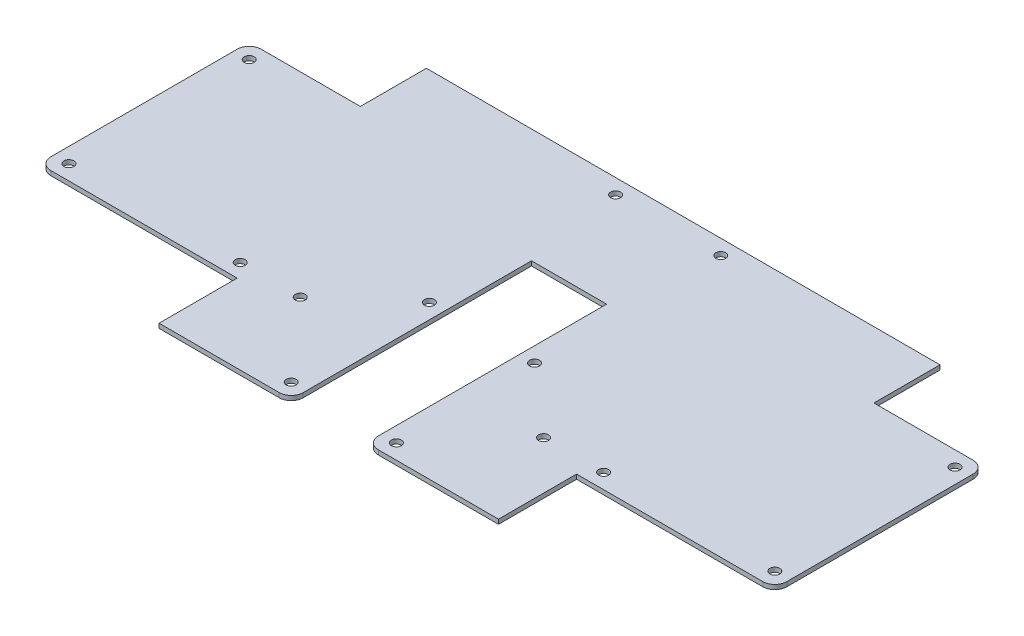
ISO-10303-21;
HEADER;
FILE_DESCRIPTION(('STEP AP214'),'2;1');
FILE_NAME('part.step','',(''),(''),'','','');
FILE_SCHEMA(('AUTOMOTIVE_DESIGN { 1 0 10303 214 1 1 1 1 }'));
ENDSEC;
DATA;
#1=APPLICATION_CONTEXT('core data for automotive mechanical design processes');
#2=APPLICATION_PROTOCOL_DEFINITION('international standard','automotive_design',2000,#1);
#3=PRODUCT_CONTEXT('',#1,'mechanical');
#4=PRODUCT('Part','Part','',(#3));
#5=PRODUCT_RELATED_PRODUCT_CATEGORY('part','',(#4));
#6=PRODUCT_DEFINITION_FORMATION('','',#4);
#7=PRODUCT_DEFINITION_CONTEXT('part definition',#1,'design');
#8=PRODUCT_DEFINITION('design','',#6,#7);
#9=PRODUCT_DEFINITION_SHAPE('','',#8);
#10=(LENGTH_UNIT() NAMED_UNIT(*) SI_UNIT(.MILLI.,.METRE.));
#11=(NAMED_UNIT(*) PLANE_ANGLE_UNIT() SI_UNIT($,.RADIAN.));
#12=(NAMED_UNIT(*) SI_UNIT($,.STERADIAN.) SOLID_ANGLE_UNIT());
#13=UNCERTAINTY_MEASURE_WITH_UNIT(LENGTH_MEASURE(1.E-05),#10,'distance_accuracy_value','');
#14=(GEOMETRIC_REPRESENTATION_CONTEXT(3) GLOBAL_UNCERTAINTY_ASSIGNED_CONTEXT((#13)) GLOBAL_UNIT_ASSIGNED_CONTEXT((#10,
#11,#12)) REPRESENTATION_CONTEXT('',''));
#15=CARTESIAN_POINT('',(0.,0.,0.));
#16=DIRECTION('',(0.,0.,1.));
#17=DIRECTION('',(1.,0.,0.));
#18=AXIS2_PLACEMENT_3D('',#15,#16,#17);
#19=CARTESIAN_POINT('',(0.,1.5,0.));
#20=DIRECTION('',(0.,0.,-1.));
#21=DIRECTION('',(-1.,0.,0.));
#22=AXIS2_PLACEMENT_3D('',#19,#20,#21);
#23=PLANE('',#22);
#24=DIRECTION('',(1.,0.,0.));
#25=VECTOR('',#24,1.);
#26=CARTESIAN_POINT('',(0.,0.,0.));
#27=LINE('',#26,#25);
#28=CARTESIAN_POINT('',(66.,0.,0.));
#29=VERTEX_POINT('',#28);
#30=CARTESIAN_POINT('',(106.,0.,0.));
#31=VERTEX_POINT('',#30);
#32=EDGE_CURVE('E186',#29,#31,#27,.T.);
#33=ORIENTED_EDGE('',*,*,#32,.T.);
#34=DIRECTION('',(0.,1.,0.));
#35=VECTOR('',#34,1.);
#36=CARTESIAN_POINT('',(106.,1.5,0.));
#37=LINE('',#36,#35);
#38=CARTESIAN_POINT('',(106.,1.5,0.));
#39=VERTEX_POINT('',#38);
#40=EDGE_CURVE('E293',#31,#39,#37,.T.);
#41=ORIENTED_EDGE('',*,*,#40,.T.);
#42=DIRECTION('',(1.,0.,0.));
#43=VECTOR('',#42,1.);
#44=CARTESIAN_POINT('',(0.,1.5,0.));
#45=LINE('',#44,#43);
#46=CARTESIAN_POINT('',(66.,1.5,0.));
#47=VERTEX_POINT('',#46);
#48=EDGE_CURVE('E286',#47,#39,#45,.T.);
#49=ORIENTED_EDGE('',*,*,#48,.F.);
#50=DIRECTION('',(0.,1.,0.));
#51=VECTOR('',#50,1.);
#52=CARTESIAN_POINT('',(66.,0.,0.));
#53=LINE('',#52,#51);
#54=EDGE_CURVE('E241',#29,#47,#53,.T.);
#55=ORIENTED_EDGE('',*,*,#54,.F.);
#56=EDGE_LOOP('',(#33,#41,#49,#55));
#57=FACE_BOUND('',#56,.T.);
#58=ADVANCED_FACE('F33',(#57),#23,.F.);
#59=CARTESIAN_POINT('',(0.,1.5,0.));
#60=DIRECTION('',(1.,0.,0.));
#61=DIRECTION('',(0.,0.,-1.));
#62=AXIS2_PLACEMENT_3D('',#59,#60,#61);
#63=PLANE('',#62);
#64=DIRECTION('',(0.,0.,1.));
#65=VECTOR('',#64,1.);
#66=CARTESIAN_POINT('',(0.,0.,0.));
#67=LINE('',#66,#65);
#68=CARTESIAN_POINT('',(0.,0.,-92.));
#69=VERTEX_POINT('',#68);
#70=CARTESIAN_POINT('',(0.,0.,-30.));
#71=VERTEX_POINT('',#70);
#72=EDGE_CURVE('E187',#69,#71,#67,.T.);
#73=ORIENTED_EDGE('',*,*,#72,.T.);
#74=DIRECTION('',(0.,1.,0.));
#75=VECTOR('',#74,1.);
#76=CARTESIAN_POINT('',(0.,1.5,-30.));
#77=LINE('',#76,#75);
#78=CARTESIAN_POINT('',(0.,1.5,-30.));
#79=VERTEX_POINT('',#78);
#80=EDGE_CURVE('E344',#71,#79,#77,.T.);
#81=ORIENTED_EDGE('',*,*,#80,.T.);
#82=DIRECTION('',(0.,0.,1.));
#83=VECTOR('',#82,1.);
#84=CARTESIAN_POINT('',(0.,1.5,0.));
#85=LINE('',#84,#83);
#86=CARTESIAN_POINT('',(0.,1.5,-92.));
#87=VERTEX_POINT('',#86);
#88=EDGE_CURVE('E280',#87,#79,#85,.T.);
#89=ORIENTED_EDGE('',*,*,#88,.F.);
#90=DIRECTION('',(0.,1.,0.));
#91=VECTOR('',#90,1.);
#92=CARTESIAN_POINT('',(0.,1.5,-92.));
#93=LINE('',#92,#91);
#94=EDGE_CURVE('E342',#87,#69,#93,.F.);
#95=ORIENTED_EDGE('',*,*,#94,.T.);
#96=EDGE_LOOP('',(#73,#81,#89,#95));
#97=FACE_BOUND('',#96,.T.);
#98=ADVANCED_FACE('F359',(#97),#63,.F.);
#99=CARTESIAN_POINT('',(139.,1.5,0.));
#100=VERTEX_POINT('',#99);
#101=CARTESIAN_POINT('',(179.,1.5,0.));
#102=VERTEX_POINT('',#101);
#103=EDGE_CURVE('E283',#100,#102,#45,.T.);
#104=ORIENTED_EDGE('',*,*,#103,.F.);
#105=DIRECTION('',(0.,1.,0.));
#106=VECTOR('',#105,1.);
#107=CARTESIAN_POINT('',(139.,1.5,0.));
#108=LINE('',#107,#106);
#109=CARTESIAN_POINT('',(139.,0.,0.));
#110=VERTEX_POINT('',#109);
#111=EDGE_CURVE('E56',#100,#110,#108,.F.);
#112=ORIENTED_EDGE('',*,*,#111,.T.);
#113=CARTESIAN_POINT('',(179.,0.,0.));
#114=VERTEX_POINT('',#113);
#115=EDGE_CURVE('E181',#110,#114,#27,.T.);
#116=ORIENTED_EDGE('',*,*,#115,.T.);
#117=DIRECTION('',(0.,1.,0.));
#118=VECTOR('',#117,1.);
#119=CARTESIAN_POINT('',(179.,0.,0.));
#120=LINE('',#119,#118);
#121=EDGE_CURVE('E184',#114,#102,#120,.T.);
#122=ORIENTED_EDGE('',*,*,#121,.T.);
#123=EDGE_LOOP('',(#104,#112,#116,#122));
#124=FACE_BOUND('',#123,.T.);
#125=ADVANCED_FACE('F183',(#124),#23,.F.);
#126=CARTESIAN_POINT('',(245.,1.5,0.));
#127=DIRECTION('',(-1.,0.,0.));
#128=DIRECTION('',(0.,0.,1.));
#129=AXIS2_PLACEMENT_3D('',#126,#127,#128);
#130=PLANE('',#129);
#131=DIRECTION('',(0.,0.,-1.));
#132=VECTOR('',#131,1.);
#133=CARTESIAN_POINT('',(245.,1.5,0.));
#134=LINE('',#133,#132);
#135=CARTESIAN_POINT('',(245.,1.5,-30.));
#136=VERTEX_POINT('',#135);
#137=CARTESIAN_POINT('',(245.,1.5,-92.));
#138=VERTEX_POINT('',#137);
#139=EDGE_CURVE('E287',#136,#138,#134,.T.);
#140=ORIENTED_EDGE('',*,*,#139,.F.);
#141=DIRECTION('',(0.,1.,0.));
#142=VECTOR('',#141,1.);
#143=CARTESIAN_POINT('',(245.,1.5,-30.));
#144=LINE('',#143,#142);
#145=CARTESIAN_POINT('',(245.,0.,-30.));
#146=VERTEX_POINT('',#145);
#147=EDGE_CURVE('E338',#136,#146,#144,.F.);
#148=ORIENTED_EDGE('',*,*,#147,.T.);
#149=DIRECTION('',(0.,0.,-1.));
#150=VECTOR('',#149,1.);
#151=CARTESIAN_POINT('',(245.,0.,0.));
#152=LINE('',#151,#150);
#153=CARTESIAN_POINT('',(245.,0.,-92.));
#154=VERTEX_POINT('',#153);
#155=EDGE_CURVE('E296',#146,#154,#152,.T.);
#156=ORIENTED_EDGE('',*,*,#155,.T.);
#157=DIRECTION('',(0.,1.,0.));
#158=VECTOR('',#157,1.);
#159=CARTESIAN_POINT('',(245.,1.5,-92.));
#160=LINE('',#159,#158);
#161=EDGE_CURVE('E335',#154,#138,#160,.T.);
#162=ORIENTED_EDGE('',*,*,#161,.T.);
#163=EDGE_LOOP('',(#140,#148,#156,#162));
#164=FACE_BOUND('',#163,.T.);
#165=ADVANCED_FACE('F395',(#164),#130,.F.);
#166=CARTESIAN_POINT('',(0.,1.5,-118.));
#167=DIRECTION('',(0.,0.,1.));
#168=DIRECTION('',(1.,0.,0.));
#169=AXIS2_PLACEMENT_3D('',#166,#167,#168);
#170=PLANE('',#169);
#171=DIRECTION('',(-1.,0.,0.));
#172=VECTOR('',#171,1.);
#173=CARTESIAN_POINT('',(0.,1.5,-118.));
#174=LINE('',#173,#172);
#175=CARTESIAN_POINT('',(208.,1.5,-118.));
#176=VERTEX_POINT('',#175);
#177=CARTESIAN_POINT('',(37.,1.5,-118.));
#178=VERTEX_POINT('',#177);
#179=EDGE_CURVE('E290',#176,#178,#174,.T.);
#180=ORIENTED_EDGE('',*,*,#179,.F.);
#181=DIRECTION('',(0.,1.,0.));
#182=VECTOR('',#181,1.);
#183=CARTESIAN_POINT('',(208.,0.,-118.));
#184=LINE('',#183,#182);
#185=CARTESIAN_POINT('',(208.,0.,-118.));
#186=VERTEX_POINT('',#185);
#187=EDGE_CURVE('E259',#186,#176,#184,.T.);
#188=ORIENTED_EDGE('',*,*,#187,.F.);
#189=DIRECTION('',(-1.,0.,0.));
#190=VECTOR('',#189,1.);
#191=CARTESIAN_POINT('',(0.,0.,-118.));
#192=LINE('',#191,#190);
#193=CARTESIAN_POINT('',(37.,0.,-118.));
#194=VERTEX_POINT('',#193);
#195=EDGE_CURVE('E284',#186,#194,#192,.T.);
#196=ORIENTED_EDGE('',*,*,#195,.T.);
#197=DIRECTION('',(0.,1.,0.));
#198=VECTOR('',#197,1.);
#199=CARTESIAN_POINT('',(37.,0.,-118.));
#200=LINE('',#199,#198);
#201=EDGE_CURVE('E275',#194,#178,#200,.T.);
#202=ORIENTED_EDGE('',*,*,#201,.T.);
#203=EDGE_LOOP('',(#180,#188,#196,#202));
#204=FACE_BOUND('',#203,.T.);
#205=ADVANCED_FACE('F379',(#204),#170,.F.);
#206=CARTESIAN_POINT('',(0.,1.5,0.));
#207=DIRECTION('',(0.,-1.,0.));
#208=DIRECTION('',(0.,0.,-1.));
#209=AXIS2_PLACEMENT_3D('',#206,#207,#208);
#210=PLANE('',#209);
#211=CARTESIAN_POINT('',(105.,1.5,-51.));
#212=DIRECTION('',(0.,-1.,0.));
#213=DIRECTION('',(0.,0.,-1.));
#214=AXIS2_PLACEMENT_3D('',#211,#212,#213);
#215=CIRCLE('',#214,1.65);
#216=CARTESIAN_POINT('',(105.,1.5,-52.65));
#217=VERTEX_POINT('',#216);
#218=EDGE_CURVE('E227',#217,#217,#215,.T.);
#219=ORIENTED_EDGE('',*,*,#218,.T.);
#220=EDGE_LOOP('',(#219));
#221=FACE_BOUND('',#220,.T.);
#222=CARTESIAN_POINT('',(105.,1.5,-113.));
#223=DIRECTION('',(0.,-1.,0.));
#224=DIRECTION('',(0.,0.,-1.));
#225=AXIS2_PLACEMENT_3D('',#222,#223,#224);
#226=CIRCLE('',#225,1.65);
#227=CARTESIAN_POINT('',(105.,1.5,-114.65));
#228=VERTEX_POINT('',#227);
#229=EDGE_CURVE('E769',#228,#228,#226,.T.);
#230=ORIENTED_EDGE('',*,*,#229,.T.);
#231=EDGE_LOOP('',(#230));
#232=FACE_BOUND('',#231,.T.);
#233=CARTESIAN_POINT('',(105.,1.5,-5.));
#234=DIRECTION('',(0.,-1.,0.));
#235=DIRECTION('',(0.,0.,-1.));
#236=AXIS2_PLACEMENT_3D('',#233,#234,#235);
#237=CIRCLE('',#236,1.65);
#238=CARTESIAN_POINT('',(105.,1.5,-6.65000000000001));
#239=VERTEX_POINT('',#238);
#240=EDGE_CURVE('E771',#239,#239,#237,.T.);
#241=ORIENTED_EDGE('',*,*,#240,.T.);
#242=EDGE_LOOP('',(#241));
#243=FACE_BOUND('',#242,.T.);
#244=CARTESIAN_POINT('',(5.,1.5,-91.));
#245=DIRECTION('',(0.,-1.,0.));
#246=DIRECTION('',(0.,0.,-1.));
#247=AXIS2_PLACEMENT_3D('',#244,#245,#246);
#248=CIRCLE('',#247,1.65);
#249=CARTESIAN_POINT('',(5.,1.5,-92.65));
#250=VERTEX_POINT('',#249);
#251=EDGE_CURVE('E776',#250,#250,#248,.T.);
#252=ORIENTED_EDGE('',*,*,#251,.T.);
#253=EDGE_LOOP('',(#252));
#254=FACE_BOUND('',#253,.T.);
#255=CARTESIAN_POINT('',(240.,1.5,-31.));
#256=DIRECTION('',(0.,-1.,0.));
#257=DIRECTION('',(0.,0.,-1.));
#258=AXIS2_PLACEMENT_3D('',#255,#256,#257);
#259=CIRCLE('',#258,1.65000000000002);
#260=CARTESIAN_POINT('',(240.,1.5,-32.65));
#261=VERTEX_POINT('',#260);
#262=EDGE_CURVE('E779',#261,#261,#259,.T.);
#263=ORIENTED_EDGE('',*,*,#262,.T.);
#264=EDGE_LOOP('',(#263));
#265=FACE_BOUND('',#264,.T.);
#266=CARTESIAN_POINT('',(140.,1.5,-113.));
#267=DIRECTION('',(0.,-1.,0.));
#268=DIRECTION('',(0.,0.,-1.));
#269=AXIS2_PLACEMENT_3D('',#266,#267,#268);
#270=CIRCLE('',#269,1.65000000000002);
#271=CARTESIAN_POINT('',(140.,1.5,-114.65));
#272=VERTEX_POINT('',#271);
#273=EDGE_CURVE('E782',#272,#272,#270,.T.);
#274=ORIENTED_EDGE('',*,*,#273,.T.);
#275=EDGE_LOOP('',(#274));
#276=FACE_BOUND('',#275,.T.);
#277=CARTESIAN_POINT('',(140.,1.5,-5.));
#278=DIRECTION('',(0.,-1.,0.));
#279=DIRECTION('',(0.,0.,-1.));
#280=AXIS2_PLACEMENT_3D('',#277,#278,#279);
#281=CIRCLE('',#280,1.65000000000002);
#282=CARTESIAN_POINT('',(140.,1.5,-6.65000000000002));
#283=VERTEX_POINT('',#282);
#284=EDGE_CURVE('E785',#283,#283,#281,.T.);
#285=ORIENTED_EDGE('',*,*,#284,.T.);
#286=EDGE_LOOP('',(#285));
#287=FACE_BOUND('',#286,.T.);
#288=CARTESIAN_POINT('',(140.,1.5,-51.));
#289=DIRECTION('',(0.,-1.,0.));
#290=DIRECTION('',(0.,0.,-1.));
#291=AXIS2_PLACEMENT_3D('',#288,#289,#290);
#292=CIRCLE('',#291,1.65000000000002);
#293=CARTESIAN_POINT('',(140.,1.5,-52.65));
#294=VERTEX_POINT('',#293);
#295=EDGE_CURVE('E788',#294,#294,#292,.T.);
#296=ORIENTED_EDGE('',*,*,#295,.T.);
#297=EDGE_LOOP('',(#296));
#298=FACE_BOUND('',#297,.T.);
#299=CARTESIAN_POINT('',(183.,1.5,-31.));
#300=DIRECTION('',(0.,-1.,0.));
#301=DIRECTION('',(0.,0.,-1.));
#302=AXIS2_PLACEMENT_3D('',#299,#300,#301);
#303=CIRCLE('',#302,1.64999999999999);
#304=CARTESIAN_POINT('',(183.,1.5,-32.65));
#305=VERTEX_POINT('',#304);
#306=EDGE_CURVE('E791',#305,#305,#303,.T.);
#307=ORIENTED_EDGE('',*,*,#306,.T.);
#308=EDGE_LOOP('',(#307));
#309=FACE_BOUND('',#308,.T.);
#310=CARTESIAN_POINT('',(240.,1.5,-91.));
#311=DIRECTION('',(0.,-1.,0.));
#312=DIRECTION('',(0.,0.,-1.));
#313=AXIS2_PLACEMENT_3D('',#310,#311,#312);
#314=CIRCLE('',#313,1.65000000000002);
#315=CARTESIAN_POINT('',(240.,1.5,-92.65));
#316=VERTEX_POINT('',#315);
#317=EDGE_CURVE('E794',#316,#316,#314,.T.);
#318=ORIENTED_EDGE('',*,*,#317,.T.);
#319=EDGE_LOOP('',(#318));
#320=FACE_BOUND('',#319,.T.);
#321=CARTESIAN_POINT('',(62.,1.5,-31.));
#322=DIRECTION('',(0.,-1.,0.));
#323=DIRECTION('',(0.,0.,-1.));
#324=AXIS2_PLACEMENT_3D('',#321,#322,#323);
#325=CIRCLE('',#324,1.65);
#326=CARTESIAN_POINT('',(62.,1.5,-32.65));
#327=VERTEX_POINT('',#326);
#328=EDGE_CURVE('E797',#327,#327,#325,.T.);
#329=ORIENTED_EDGE('',*,*,#328,.T.);
#330=EDGE_LOOP('',(#329));
#331=FACE_BOUND('',#330,.T.);
#332=CARTESIAN_POINT('',(82.,1.5,-31.));
#333=DIRECTION('',(0.,-1.,0.));
#334=DIRECTION('',(0.,0.,-1.));
#335=AXIS2_PLACEMENT_3D('',#332,#333,#334);
#336=CIRCLE('',#335,1.65);
#337=CARTESIAN_POINT('',(82.,1.5,-32.65));
#338=VERTEX_POINT('',#337);
#339=EDGE_CURVE('E800',#338,#338,#336,.T.);
#340=ORIENTED_EDGE('',*,*,#339,.T.);
#341=EDGE_LOOP('',(#340));
#342=FACE_BOUND('',#341,.T.);
#343=CARTESIAN_POINT('',(163.,1.5,-31.));
#344=DIRECTION('',(0.,-1.,0.));
#345=DIRECTION('',(0.,0.,-1.));
#346=AXIS2_PLACEMENT_3D('',#343,#344,#345);
#347=CIRCLE('',#346,1.64999999999999);
#348=CARTESIAN_POINT('',(163.,1.5,-32.65));
#349=VERTEX_POINT('',#348);
#350=EDGE_CURVE('E803',#349,#349,#347,.T.);
#351=ORIENTED_EDGE('',*,*,#350,.T.);
#352=EDGE_LOOP('',(#351));
#353=FACE_BOUND('',#352,.T.);
#354=CARTESIAN_POINT('',(5.,1.5,-31.));
#355=DIRECTION('',(0.,-1.,0.));
#356=DIRECTION('',(0.,0.,-1.));
#357=AXIS2_PLACEMENT_3D('',#354,#355,#356);
#358=CIRCLE('',#357,1.65);
#359=CARTESIAN_POINT('',(5.,1.5,-32.65));
#360=VERTEX_POINT('',#359);
#361=EDGE_CURVE('E806',#360,#360,#358,.T.);
#362=ORIENTED_EDGE('',*,*,#361,.T.);
#363=EDGE_LOOP('',(#362));
#364=FACE_BOUND('',#363,.T.);
#365=ORIENTED_EDGE('',*,*,#48,.T.);
#366=CARTESIAN_POINT('',(106.,1.5,-4.));
#367=DIRECTION('',(0.,-1.,0.));
#368=DIRECTION('',(0.,0.,-1.));
#369=AXIS2_PLACEMENT_3D('',#366,#367,#368);
#370=CIRCLE('',#369,4.);
#371=CARTESIAN_POINT('',(110.,1.5,-4.));
#372=VERTEX_POINT('',#371);
#373=EDGE_CURVE('E313',#39,#372,#370,.F.);
#374=ORIENTED_EDGE('',*,*,#373,.T.);
#375=DIRECTION('',(0.,0.,1.));
#376=VECTOR('',#375,1.);
#377=CARTESIAN_POINT('',(110.,1.5,0.));
#378=LINE('',#377,#376);
#379=CARTESIAN_POINT('',(110.,1.5,-80.));
#380=VERTEX_POINT('',#379);
#381=EDGE_CURVE('E223',#380,#372,#378,.T.);
#382=ORIENTED_EDGE('',*,*,#381,.F.);
#383=DIRECTION('',(-1.,0.,0.));
#384=VECTOR('',#383,1.);
#385=CARTESIAN_POINT('',(110.,1.5,-80.));
#386=LINE('',#385,#384);
#387=CARTESIAN_POINT('',(135.,1.5,-80.));
#388=VERTEX_POINT('',#387);
#389=EDGE_CURVE('E217',#388,#380,#386,.T.);
#390=ORIENTED_EDGE('',*,*,#389,.F.);
#391=DIRECTION('',(0.,0.,-1.));
#392=VECTOR('',#391,1.);
#393=CARTESIAN_POINT('',(135.,1.5,0.));
#394=LINE('',#393,#392);
#395=CARTESIAN_POINT('',(135.,1.5,-4.));
#396=VERTEX_POINT('',#395);
#397=EDGE_CURVE('E226',#396,#388,#394,.T.);
#398=ORIENTED_EDGE('',*,*,#397,.F.);
#399=CARTESIAN_POINT('',(139.,1.5,-4.));
#400=DIRECTION('',(0.,-1.,0.));
#401=DIRECTION('',(0.,0.,-1.));
#402=AXIS2_PLACEMENT_3D('',#399,#400,#401);
#403=CIRCLE('',#402,4.);
#404=EDGE_CURVE('E311',#396,#100,#403,.F.);
#405=ORIENTED_EDGE('',*,*,#404,.T.);
#406=ORIENTED_EDGE('',*,*,#103,.T.);
#407=DIRECTION('',(0.,0.,1.));
#408=VECTOR('',#407,1.);
#409=CARTESIAN_POINT('',(179.,1.5,0.));
#410=LINE('',#409,#408);
#411=CARTESIAN_POINT('',(179.,1.5,-26.));
#412=VERTEX_POINT('',#411);
#413=EDGE_CURVE('E197',#412,#102,#410,.T.);
#414=ORIENTED_EDGE('',*,*,#413,.F.);
#415=DIRECTION('',(-1.,0.,0.));
#416=VECTOR('',#415,1.);
#417=CARTESIAN_POINT('',(245.,1.5,-26.));
#418=LINE('',#417,#416);
#419=CARTESIAN_POINT('',(241.,1.5,-26.));
#420=VERTEX_POINT('',#419);
#421=EDGE_CURVE('E210',#420,#412,#418,.T.);
#422=ORIENTED_EDGE('',*,*,#421,.F.);
#423=CARTESIAN_POINT('',(241.,1.5,-30.));
#424=DIRECTION('',(0.,-1.,0.));
#425=DIRECTION('',(0.,0.,-1.));
#426=AXIS2_PLACEMENT_3D('',#423,#424,#425);
#427=CIRCLE('',#426,4.);
#428=EDGE_CURVE('E309',#420,#136,#427,.F.);
#429=ORIENTED_EDGE('',*,*,#428,.T.);
#430=ORIENTED_EDGE('',*,*,#139,.T.);
#431=CARTESIAN_POINT('',(241.,1.5,-92.));
#432=DIRECTION('',(0.,-1.,0.));
#433=DIRECTION('',(0.,0.,-1.));
#434=AXIS2_PLACEMENT_3D('',#431,#432,#433);
#435=CIRCLE('',#434,4.);
#436=CARTESIAN_POINT('',(241.,1.5,-96.));
#437=VERTEX_POINT('',#436);
#438=EDGE_CURVE('E307',#138,#437,#435,.F.);
#439=ORIENTED_EDGE('',*,*,#438,.T.);
#440=DIRECTION('',(1.,0.,0.));
#441=VECTOR('',#440,1.);
#442=CARTESIAN_POINT('',(245.,1.5,-96.));
#443=LINE('',#442,#441);
#444=CARTESIAN_POINT('',(208.,1.5,-96.));
#445=VERTEX_POINT('',#444);
#446=EDGE_CURVE('E256',#445,#437,#443,.T.);
#447=ORIENTED_EDGE('',*,*,#446,.F.);
#448=DIRECTION('',(0.,0.,1.));
#449=VECTOR('',#448,1.);
#450=CARTESIAN_POINT('',(208.,1.5,-118.));
#451=LINE('',#450,#449);
#452=EDGE_CURVE('E198',#176,#445,#451,.T.);
#453=ORIENTED_EDGE('',*,*,#452,.F.);
#454=ORIENTED_EDGE('',*,*,#179,.T.);
#455=DIRECTION('',(0.,0.,-1.));
#456=VECTOR('',#455,1.);
#457=CARTESIAN_POINT('',(37.,1.5,-118.));
#458=LINE('',#457,#456);
#459=CARTESIAN_POINT('',(37.,1.5,-96.));
#460=VERTEX_POINT('',#459);
#461=EDGE_CURVE('E269',#460,#178,#458,.T.);
#462=ORIENTED_EDGE('',*,*,#461,.F.);
#463=DIRECTION('',(1.,0.,0.));
#464=VECTOR('',#463,1.);
#465=CARTESIAN_POINT('',(0.,1.5,-96.));
#466=LINE('',#465,#464);
#467=CARTESIAN_POINT('',(4.,1.5,-96.));
#468=VERTEX_POINT('',#467);
#469=EDGE_CURVE('E250',#468,#460,#466,.T.);
#470=ORIENTED_EDGE('',*,*,#469,.F.);
#471=CARTESIAN_POINT('',(4.,1.5,-92.));
#472=DIRECTION('',(0.,-1.,0.));
#473=DIRECTION('',(0.,0.,-1.));
#474=AXIS2_PLACEMENT_3D('',#471,#472,#473);
#475=CIRCLE('',#474,4.);
#476=EDGE_CURVE('E303',#468,#87,#475,.F.);
#477=ORIENTED_EDGE('',*,*,#476,.T.);
#478=ORIENTED_EDGE('',*,*,#88,.T.);
#479=CARTESIAN_POINT('',(4.,1.5,-30.));
#480=DIRECTION('',(0.,-1.,0.));
#481=DIRECTION('',(0.,0.,-1.));
#482=AXIS2_PLACEMENT_3D('',#479,#480,#481);
#483=CIRCLE('',#482,4.);
#484=CARTESIAN_POINT('',(4.,1.5,-26.));
#485=VERTEX_POINT('',#484);
#486=EDGE_CURVE('E305',#79,#485,#483,.F.);
#487=ORIENTED_EDGE('',*,*,#486,.T.);
#488=DIRECTION('',(-1.,0.,0.));
#489=VECTOR('',#488,1.);
#490=CARTESIAN_POINT('',(0.,1.5,-26.));
#491=LINE('',#490,#489);
#492=CARTESIAN_POINT('',(66.,1.5,-26.));
#493=VERTEX_POINT('',#492);
#494=EDGE_CURVE('E238',#493,#485,#491,.T.);
#495=ORIENTED_EDGE('',*,*,#494,.F.);
#496=DIRECTION('',(0.,0.,-1.));
#497=VECTOR('',#496,1.);
#498=CARTESIAN_POINT('',(66.,1.5,0.));
#499=LINE('',#498,#497);
#500=EDGE_CURVE('E242',#47,#493,#499,.T.);
#501=ORIENTED_EDGE('',*,*,#500,.F.);
#502=EDGE_LOOP('',(#365,#374,#382,#390,#398,#405,#406,#414,#422,#429,#430,#439,#447,#453,#454,
#462,#470,#477,#478,#487,#495,#501));
#503=FACE_BOUND('',#502,.T.);
#504=ADVANCED_FACE('F363',(#221,#232,#243,#254,#265,#276,#287,#298,#309,#320,#331,#342,#353,
#364,#503),#210,.F.);
#505=CARTESIAN_POINT('',(0.,0.,0.));
#506=DIRECTION('',(0.,-1.,0.));
#507=DIRECTION('',(0.,0.,-1.));
#508=AXIS2_PLACEMENT_3D('',#505,#506,#507);
#509=PLANE('',#508);
#510=CARTESIAN_POINT('',(105.,0.,-51.));
#511=DIRECTION('',(0.,-1.,0.));
#512=DIRECTION('',(0.,0.,-1.));
#513=AXIS2_PLACEMENT_3D('',#510,#511,#512);
#514=CIRCLE('',#513,1.65);
#515=CARTESIAN_POINT('',(105.,0.,-52.65));
#516=VERTEX_POINT('',#515);
#517=EDGE_CURVE('E766',#516,#516,#514,.T.);
#518=ORIENTED_EDGE('',*,*,#517,.F.);
#519=EDGE_LOOP('',(#518));
#520=FACE_BOUND('',#519,.T.);
#521=CARTESIAN_POINT('',(105.,0.,-113.));
#522=DIRECTION('',(0.,-1.,0.));
#523=DIRECTION('',(0.,0.,-1.));
#524=AXIS2_PLACEMENT_3D('',#521,#522,#523);
#525=CIRCLE('',#524,1.65);
#526=CARTESIAN_POINT('',(105.,0.,-114.65));
#527=VERTEX_POINT('',#526);
#528=EDGE_CURVE('E829',#527,#527,#525,.T.);
#529=ORIENTED_EDGE('',*,*,#528,.F.);
#530=EDGE_LOOP('',(#529));
#531=FACE_BOUND('',#530,.T.);
#532=CARTESIAN_POINT('',(105.,0.,-5.));
#533=DIRECTION('',(0.,-1.,0.));
#534=DIRECTION('',(0.,0.,-1.));
#535=AXIS2_PLACEMENT_3D('',#532,#533,#534);
#536=CIRCLE('',#535,1.65);
#537=CARTESIAN_POINT('',(105.,0.,-6.65000000000001));
#538=VERTEX_POINT('',#537);
#539=EDGE_CURVE('E826',#538,#538,#536,.T.);
#540=ORIENTED_EDGE('',*,*,#539,.F.);
#541=EDGE_LOOP('',(#540));
#542=FACE_BOUND('',#541,.T.);
#543=CARTESIAN_POINT('',(5.,0.,-91.));
#544=DIRECTION('',(0.,-1.,0.));
#545=DIRECTION('',(0.,0.,-1.));
#546=AXIS2_PLACEMENT_3D('',#543,#544,#545);
#547=CIRCLE('',#546,1.65);
#548=CARTESIAN_POINT('',(5.,0.,-92.65));
#549=VERTEX_POINT('',#548);
#550=EDGE_CURVE('E812',#549,#549,#547,.T.);
#551=ORIENTED_EDGE('',*,*,#550,.F.);
#552=EDGE_LOOP('',(#551));
#553=FACE_BOUND('',#552,.T.);
#554=CARTESIAN_POINT('',(240.,0.,-31.));
#555=DIRECTION('',(0.,-1.,0.));
#556=DIRECTION('',(0.,0.,1.));
#557=AXIS2_PLACEMENT_3D('',#554,#555,#556);
#558=CIRCLE('',#557,1.65000000000002);
#559=CARTESIAN_POINT('',(240.,0.,-29.35));
#560=VERTEX_POINT('',#559);
#561=EDGE_CURVE('E820',#560,#560,#558,.T.);
#562=ORIENTED_EDGE('',*,*,#561,.F.);
#563=EDGE_LOOP('',(#562));
#564=FACE_BOUND('',#563,.T.);
#565=CARTESIAN_POINT('',(140.,0.,-113.));
#566=DIRECTION('',(0.,-1.,0.));
#567=DIRECTION('',(0.,0.,1.));
#568=AXIS2_PLACEMENT_3D('',#565,#566,#567);
#569=CIRCLE('',#568,1.65000000000002);
#570=CARTESIAN_POINT('',(140.,0.,-111.35));
#571=VERTEX_POINT('',#570);
#572=EDGE_CURVE('E817',#571,#571,#569,.T.);
#573=ORIENTED_EDGE('',*,*,#572,.F.);
#574=EDGE_LOOP('',(#573));
#575=FACE_BOUND('',#574,.T.);
#576=CARTESIAN_POINT('',(140.,0.,-5.));
#577=DIRECTION('',(0.,-1.,0.));
#578=DIRECTION('',(0.,0.,1.));
#579=AXIS2_PLACEMENT_3D('',#576,#577,#578);
#580=CIRCLE('',#579,1.65000000000002);
#581=CARTESIAN_POINT('',(140.,0.,-3.34999999999999));
#582=VERTEX_POINT('',#581);
#583=EDGE_CURVE('E813',#582,#582,#580,.T.);
#584=ORIENTED_EDGE('',*,*,#583,.F.);
#585=EDGE_LOOP('',(#584));
#586=FACE_BOUND('',#585,.T.);
#587=CARTESIAN_POINT('',(140.,0.,-51.));
#588=DIRECTION('',(0.,-1.,0.));
#589=DIRECTION('',(0.,0.,1.));
#590=AXIS2_PLACEMENT_3D('',#587,#588,#589);
#591=CIRCLE('',#590,1.65000000000002);
#592=CARTESIAN_POINT('',(140.,0.,-49.35));
#593=VERTEX_POINT('',#592);
#594=EDGE_CURVE('E816',#593,#593,#591,.T.);
#595=ORIENTED_EDGE('',*,*,#594,.F.);
#596=EDGE_LOOP('',(#595));
#597=FACE_BOUND('',#596,.T.);
#598=CARTESIAN_POINT('',(183.,0.,-31.));
#599=DIRECTION('',(0.,-1.,0.));
#600=DIRECTION('',(0.,0.,1.));
#601=AXIS2_PLACEMENT_3D('',#598,#599,#600);
#602=CIRCLE('',#601,1.64999999999999);
#603=CARTESIAN_POINT('',(183.,0.,-29.35));
#604=VERTEX_POINT('',#603);
#605=EDGE_CURVE('E844',#604,#604,#602,.T.);
#606=ORIENTED_EDGE('',*,*,#605,.F.);
#607=EDGE_LOOP('',(#606));
#608=FACE_BOUND('',#607,.T.);
#609=CARTESIAN_POINT('',(240.,0.,-91.));
#610=DIRECTION('',(0.,-1.,0.));
#611=DIRECTION('',(0.,0.,1.));
#612=AXIS2_PLACEMENT_3D('',#609,#610,#611);
#613=CIRCLE('',#612,1.65000000000002);
#614=CARTESIAN_POINT('',(240.,0.,-89.35));
#615=VERTEX_POINT('',#614);
#616=EDGE_CURVE('E823',#615,#615,#613,.T.);
#617=ORIENTED_EDGE('',*,*,#616,.F.);
#618=EDGE_LOOP('',(#617));
#619=FACE_BOUND('',#618,.T.);
#620=CARTESIAN_POINT('',(62.,0.,-31.));
#621=DIRECTION('',(0.,-1.,0.));
#622=DIRECTION('',(0.,0.,-1.));
#623=AXIS2_PLACEMENT_3D('',#620,#621,#622);
#624=CIRCLE('',#623,1.65);
#625=CARTESIAN_POINT('',(62.,0.,-32.65));
#626=VERTEX_POINT('',#625);
#627=EDGE_CURVE('E835',#626,#626,#624,.T.);
#628=ORIENTED_EDGE('',*,*,#627,.F.);
#629=EDGE_LOOP('',(#628));
#630=FACE_BOUND('',#629,.T.);
#631=CARTESIAN_POINT('',(82.,0.,-31.));
#632=DIRECTION('',(0.,-1.,0.));
#633=DIRECTION('',(0.,0.,-1.));
#634=AXIS2_PLACEMENT_3D('',#631,#632,#633);
#635=CIRCLE('',#634,1.65);
#636=CARTESIAN_POINT('',(82.,0.,-32.65));
#637=VERTEX_POINT('',#636);
#638=EDGE_CURVE('E838',#637,#637,#635,.T.);
#639=ORIENTED_EDGE('',*,*,#638,.F.);
#640=EDGE_LOOP('',(#639));
#641=FACE_BOUND('',#640,.T.);
#642=CARTESIAN_POINT('',(163.,0.,-31.));
#643=DIRECTION('',(0.,-1.,0.));
#644=DIRECTION('',(0.,0.,1.));
#645=AXIS2_PLACEMENT_3D('',#642,#643,#644);
#646=CIRCLE('',#645,1.64999999999999);
#647=CARTESIAN_POINT('',(163.,0.,-29.35));
#648=VERTEX_POINT('',#647);
#649=EDGE_CURVE('E841',#648,#648,#646,.T.);
#650=ORIENTED_EDGE('',*,*,#649,.F.);
#651=EDGE_LOOP('',(#650));
#652=FACE_BOUND('',#651,.T.);
#653=CARTESIAN_POINT('',(5.,0.,-31.));
#654=DIRECTION('',(0.,-1.,0.));
#655=DIRECTION('',(0.,0.,-1.));
#656=AXIS2_PLACEMENT_3D('',#653,#654,#655);
#657=CIRCLE('',#656,1.65);
#658=CARTESIAN_POINT('',(5.,0.,-32.65));
#659=VERTEX_POINT('',#658);
#660=EDGE_CURVE('E809',#659,#659,#657,.T.);
#661=ORIENTED_EDGE('',*,*,#660,.F.);
#662=EDGE_LOOP('',(#661));
#663=FACE_BOUND('',#662,.T.);
#664=DIRECTION('',(0.,0.,1.));
#665=VECTOR('',#664,1.);
#666=CARTESIAN_POINT('',(110.,0.,0.));
#667=LINE('',#666,#665);
#668=CARTESIAN_POINT('',(110.,0.,-80.));
#669=VERTEX_POINT('',#668);
#670=CARTESIAN_POINT('',(110.,0.,-4.));
#671=VERTEX_POINT('',#670);
#672=EDGE_CURVE('E214',#669,#671,#667,.T.);
#673=ORIENTED_EDGE('',*,*,#672,.T.);
#674=CARTESIAN_POINT('',(106.,0.,-4.));
#675=DIRECTION('',(0.,-1.,0.));
#676=DIRECTION('',(0.,0.,-1.));
#677=AXIS2_PLACEMENT_3D('',#674,#675,#676);
#678=CIRCLE('',#677,4.);
#679=EDGE_CURVE('E326',#671,#31,#678,.T.);
#680=ORIENTED_EDGE('',*,*,#679,.T.);
#681=ORIENTED_EDGE('',*,*,#32,.F.);
#682=DIRECTION('',(0.,0.,-1.));
#683=VECTOR('',#682,1.);
#684=CARTESIAN_POINT('',(66.,0.,0.));
#685=LINE('',#684,#683);
#686=CARTESIAN_POINT('',(66.,0.,-26.));
#687=VERTEX_POINT('',#686);
#688=EDGE_CURVE('E234',#29,#687,#685,.T.);
#689=ORIENTED_EDGE('',*,*,#688,.T.);
#690=DIRECTION('',(-1.,0.,0.));
#691=VECTOR('',#690,1.);
#692=CARTESIAN_POINT('',(0.,0.,-26.));
#693=LINE('',#692,#691);
#694=CARTESIAN_POINT('',(4.,0.,-26.));
#695=VERTEX_POINT('',#694);
#696=EDGE_CURVE('E237',#687,#695,#693,.T.);
#697=ORIENTED_EDGE('',*,*,#696,.T.);
#698=CARTESIAN_POINT('',(4.,0.,-30.));
#699=DIRECTION('',(0.,-1.,0.));
#700=DIRECTION('',(0.,0.,-1.));
#701=AXIS2_PLACEMENT_3D('',#698,#699,#700);
#702=CIRCLE('',#701,4.);
#703=EDGE_CURVE('E319',#695,#71,#702,.T.);
#704=ORIENTED_EDGE('',*,*,#703,.T.);
#705=ORIENTED_EDGE('',*,*,#72,.F.);
#706=CARTESIAN_POINT('',(4.,0.,-92.));
#707=DIRECTION('',(0.,-1.,0.));
#708=DIRECTION('',(0.,0.,-1.));
#709=AXIS2_PLACEMENT_3D('',#706,#707,#708);
#710=CIRCLE('',#709,4.);
#711=CARTESIAN_POINT('',(4.,0.,-96.));
#712=VERTEX_POINT('',#711);
#713=EDGE_CURVE('E317',#69,#712,#710,.T.);
#714=ORIENTED_EDGE('',*,*,#713,.T.);
#715=DIRECTION('',(1.,0.,0.));
#716=VECTOR('',#715,1.);
#717=CARTESIAN_POINT('',(0.,0.,-96.));
#718=LINE('',#717,#716);
#719=CARTESIAN_POINT('',(37.,0.,-96.));
#720=VERTEX_POINT('',#719);
#721=EDGE_CURVE('E266',#712,#720,#718,.T.);
#722=ORIENTED_EDGE('',*,*,#721,.T.);
#723=DIRECTION('',(0.,0.,-1.));
#724=VECTOR('',#723,1.);
#725=CARTESIAN_POINT('',(37.,0.,-118.));
#726=LINE('',#725,#724);
#727=EDGE_CURVE('E268',#720,#194,#726,.T.);
#728=ORIENTED_EDGE('',*,*,#727,.T.);
#729=ORIENTED_EDGE('',*,*,#195,.F.);
#730=DIRECTION('',(0.,0.,1.));
#731=VECTOR('',#730,1.);
#732=CARTESIAN_POINT('',(208.,0.,-118.));
#733=LINE('',#732,#731);
#734=CARTESIAN_POINT('',(208.,0.,-96.));
#735=VERTEX_POINT('',#734);
#736=EDGE_CURVE('E252',#186,#735,#733,.T.);
#737=ORIENTED_EDGE('',*,*,#736,.T.);
#738=DIRECTION('',(1.,0.,0.));
#739=VECTOR('',#738,1.);
#740=CARTESIAN_POINT('',(245.,0.,-96.));
#741=LINE('',#740,#739);
#742=CARTESIAN_POINT('',(241.,0.,-96.));
#743=VERTEX_POINT('',#742);
#744=EDGE_CURVE('E255',#735,#743,#741,.T.);
#745=ORIENTED_EDGE('',*,*,#744,.T.);
#746=CARTESIAN_POINT('',(241.,0.,-92.));
#747=DIRECTION('',(0.,-1.,0.));
#748=DIRECTION('',(0.,0.,-1.));
#749=AXIS2_PLACEMENT_3D('',#746,#747,#748);
#750=CIRCLE('',#749,4.);
#751=EDGE_CURVE('E321',#743,#154,#750,.T.);
#752=ORIENTED_EDGE('',*,*,#751,.T.);
#753=ORIENTED_EDGE('',*,*,#155,.F.);
#754=CARTESIAN_POINT('',(241.,0.,-30.));
#755=DIRECTION('',(0.,-1.,0.));
#756=DIRECTION('',(0.,0.,-1.));
#757=AXIS2_PLACEMENT_3D('',#754,#755,#756);
#758=CIRCLE('',#757,4.);
#759=CARTESIAN_POINT('',(241.,0.,-26.));
#760=VERTEX_POINT('',#759);
#761=EDGE_CURVE('E323',#146,#760,#758,.T.);
#762=ORIENTED_EDGE('',*,*,#761,.T.);
#763=DIRECTION('',(-1.,0.,0.));
#764=VECTOR('',#763,1.);
#765=CARTESIAN_POINT('',(245.,0.,-26.));
#766=LINE('',#765,#764);
#767=CARTESIAN_POINT('',(179.,0.,-26.));
#768=VERTEX_POINT('',#767);
#769=EDGE_CURVE('E204',#760,#768,#766,.T.);
#770=ORIENTED_EDGE('',*,*,#769,.T.);
#771=DIRECTION('',(0.,0.,1.));
#772=VECTOR('',#771,1.);
#773=CARTESIAN_POINT('',(179.,0.,0.));
#774=LINE('',#773,#772);
#775=EDGE_CURVE('E194',#768,#114,#774,.T.);
#776=ORIENTED_EDGE('',*,*,#775,.T.);
#777=ORIENTED_EDGE('',*,*,#115,.F.);
#778=CARTESIAN_POINT('',(139.,0.,-4.));
#779=DIRECTION('',(0.,-1.,0.));
#780=DIRECTION('',(0.,0.,-1.));
#781=AXIS2_PLACEMENT_3D('',#778,#779,#780);
#782=CIRCLE('',#781,4.);
#783=CARTESIAN_POINT('',(135.,0.,-4.));
#784=VERTEX_POINT('',#783);
#785=EDGE_CURVE('E48',#110,#784,#782,.T.);
#786=ORIENTED_EDGE('',*,*,#785,.T.);
#787=DIRECTION('',(0.,0.,-1.));
#788=VECTOR('',#787,1.);
#789=CARTESIAN_POINT('',(135.,0.,0.));
#790=LINE('',#789,#788);
#791=CARTESIAN_POINT('',(135.,0.,-80.));
#792=VERTEX_POINT('',#791);
#793=EDGE_CURVE('E216',#784,#792,#790,.T.);
#794=ORIENTED_EDGE('',*,*,#793,.T.);
#795=DIRECTION('',(-1.,0.,0.));
#796=VECTOR('',#795,1.);
#797=CARTESIAN_POINT('',(110.,0.,-80.));
#798=LINE('',#797,#796);
#799=EDGE_CURVE('E219',#792,#669,#798,.T.);
#800=ORIENTED_EDGE('',*,*,#799,.T.);
#801=EDGE_LOOP('',(#673,#680,#681,#689,#697,#704,#705,#714,#722,#728,#729,#737,#745,#752,#753,
#762,#770,#776,#777,#786,#794,#800));
#802=FACE_BOUND('',#801,.T.);
#803=ADVANCED_FACE('F202',(#520,#531,#542,#553,#564,#575,#586,#597,#608,#619,#630,#641,#652,
#663,#802),#509,.T.);
#804=CARTESIAN_POINT('',(37.,0.,-118.));
#805=DIRECTION('',(1.,0.,0.));
#806=DIRECTION('',(0.,0.,-1.));
#807=AXIS2_PLACEMENT_3D('',#804,#805,#806);
#808=PLANE('',#807);
#809=ORIENTED_EDGE('',*,*,#461,.T.);
#810=ORIENTED_EDGE('',*,*,#201,.F.);
#811=ORIENTED_EDGE('',*,*,#727,.F.);
#812=DIRECTION('',(0.,1.,0.));
#813=VECTOR('',#812,1.);
#814=CARTESIAN_POINT('',(37.,0.,-96.));
#815=LINE('',#814,#813);
#816=EDGE_CURVE('E272',#720,#460,#815,.T.);
#817=ORIENTED_EDGE('',*,*,#816,.T.);
#818=EDGE_LOOP('',(#809,#810,#811,#817));
#819=FACE_BOUND('',#818,.T.);
#820=ADVANCED_FACE('F376',(#819),#808,.F.);
#821=CARTESIAN_POINT('',(0.,0.,-96.));
#822=DIRECTION('',(0.,0.,1.));
#823=DIRECTION('',(1.,0.,0.));
#824=AXIS2_PLACEMENT_3D('',#821,#822,#823);
#825=PLANE('',#824);
#826=ORIENTED_EDGE('',*,*,#721,.F.);
#827=DIRECTION('',(0.,1.,0.));
#828=VECTOR('',#827,1.);
#829=CARTESIAN_POINT('',(4.,0.,-96.));
#830=LINE('',#829,#828);
#831=EDGE_CURVE('E11',#712,#468,#830,.T.);
#832=ORIENTED_EDGE('',*,*,#831,.T.);
#833=ORIENTED_EDGE('',*,*,#469,.T.);
#834=ORIENTED_EDGE('',*,*,#816,.F.);
#835=EDGE_LOOP('',(#826,#832,#833,#834));
#836=FACE_BOUND('',#835,.T.);
#837=ADVANCED_FACE('F371',(#836),#825,.F.);
#838=CARTESIAN_POINT('',(110.,0.,0.));
#839=DIRECTION('',(-1.,0.,0.));
#840=DIRECTION('',(0.,0.,1.));
#841=AXIS2_PLACEMENT_3D('',#838,#839,#840);
#842=PLANE('',#841);
#843=ORIENTED_EDGE('',*,*,#381,.T.);
#844=DIRECTION('',(0.,1.,0.));
#845=VECTOR('',#844,1.);
#846=CARTESIAN_POINT('',(110.,0.,-4.));
#847=LINE('',#846,#845);
#848=EDGE_CURVE('E315',#372,#671,#847,.F.);
#849=ORIENTED_EDGE('',*,*,#848,.T.);
#850=ORIENTED_EDGE('',*,*,#672,.F.);
#851=DIRECTION('',(0.,1.,0.));
#852=VECTOR('',#851,1.);
#853=CARTESIAN_POINT('',(110.,0.,-80.));
#854=LINE('',#853,#852);
#855=EDGE_CURVE('E212',#669,#380,#854,.T.);
#856=ORIENTED_EDGE('',*,*,#855,.T.);
#857=EDGE_LOOP('',(#843,#849,#850,#856));
#858=FACE_BOUND('',#857,.T.);
#859=ADVANCED_FACE('F466',(#858),#842,.F.);
#860=CARTESIAN_POINT('',(110.,0.,-80.));
#861=DIRECTION('',(0.,0.,-1.));
#862=DIRECTION('',(-1.,0.,0.));
#863=AXIS2_PLACEMENT_3D('',#860,#861,#862);
#864=PLANE('',#863);
#865=ORIENTED_EDGE('',*,*,#389,.T.);
#866=ORIENTED_EDGE('',*,*,#855,.F.);
#867=ORIENTED_EDGE('',*,*,#799,.F.);
#868=DIRECTION('',(0.,1.,0.));
#869=VECTOR('',#868,1.);
#870=CARTESIAN_POINT('',(135.,0.,-80.));
#871=LINE('',#870,#869);
#872=EDGE_CURVE('E222',#792,#388,#871,.T.);
#873=ORIENTED_EDGE('',*,*,#872,.T.);
#874=EDGE_LOOP('',(#865,#866,#867,#873));
#875=FACE_BOUND('',#874,.T.);
#876=ADVANCED_FACE('F414',(#875),#864,.F.);
#877=CARTESIAN_POINT('',(135.,0.,0.));
#878=DIRECTION('',(1.,0.,0.));
#879=DIRECTION('',(0.,0.,-1.));
#880=AXIS2_PLACEMENT_3D('',#877,#878,#879);
#881=PLANE('',#880);
#882=ORIENTED_EDGE('',*,*,#793,.F.);
#883=DIRECTION('',(0.,1.,0.));
#884=VECTOR('',#883,1.);
#885=CARTESIAN_POINT('',(135.,0.,-4.));
#886=LINE('',#885,#884);
#887=EDGE_CURVE('E328',#784,#396,#886,.T.);
#888=ORIENTED_EDGE('',*,*,#887,.T.);
#889=ORIENTED_EDGE('',*,*,#397,.T.);
#890=ORIENTED_EDGE('',*,*,#872,.F.);
#891=EDGE_LOOP('',(#882,#888,#889,#890));
#892=FACE_BOUND('',#891,.T.);
#893=ADVANCED_FACE('F409',(#892),#881,.F.);
#894=CARTESIAN_POINT('',(179.,0.,0.));
#895=DIRECTION('',(-1.,0.,0.));
#896=DIRECTION('',(0.,0.,1.));
#897=AXIS2_PLACEMENT_3D('',#894,#895,#896);
#898=PLANE('',#897);
#899=ORIENTED_EDGE('',*,*,#413,.T.);
#900=ORIENTED_EDGE('',*,*,#121,.F.);
#901=ORIENTED_EDGE('',*,*,#775,.F.);
#902=DIRECTION('',(0.,1.,0.));
#903=VECTOR('',#902,1.);
#904=CARTESIAN_POINT('',(179.,0.,-26.));
#905=LINE('',#904,#903);
#906=EDGE_CURVE('E199',#768,#412,#905,.T.);
#907=ORIENTED_EDGE('',*,*,#906,.T.);
#908=EDGE_LOOP('',(#899,#900,#901,#907));
#909=FACE_BOUND('',#908,.T.);
#910=ADVANCED_FACE('F192',(#909),#898,.F.);
#911=CARTESIAN_POINT('',(245.,0.,-26.));
#912=DIRECTION('',(0.,0.,-1.));
#913=DIRECTION('',(-1.,0.,0.));
#914=AXIS2_PLACEMENT_3D('',#911,#912,#913);
#915=PLANE('',#914);
#916=ORIENTED_EDGE('',*,*,#769,.F.);
#917=DIRECTION('',(0.,1.,0.));
#918=VECTOR('',#917,1.);
#919=CARTESIAN_POINT('',(241.,0.,-26.));
#920=LINE('',#919,#918);
#921=EDGE_CURVE('E332',#760,#420,#920,.T.);
#922=ORIENTED_EDGE('',*,*,#921,.T.);
#923=ORIENTED_EDGE('',*,*,#421,.T.);
#924=ORIENTED_EDGE('',*,*,#906,.F.);
#925=EDGE_LOOP('',(#916,#922,#923,#924));
#926=FACE_BOUND('',#925,.T.);
#927=ADVANCED_FACE('F403',(#926),#915,.F.);
#928=CARTESIAN_POINT('',(245.,0.,-96.));
#929=DIRECTION('',(0.,0.,1.));
#930=DIRECTION('',(1.,0.,0.));
#931=AXIS2_PLACEMENT_3D('',#928,#929,#930);
#932=PLANE('',#931);
#933=ORIENTED_EDGE('',*,*,#446,.T.);
#934=DIRECTION('',(0.,1.,0.));
#935=VECTOR('',#934,1.);
#936=CARTESIAN_POINT('',(241.,0.,-96.));
#937=LINE('',#936,#935);
#938=EDGE_CURVE('E340',#437,#743,#937,.F.);
#939=ORIENTED_EDGE('',*,*,#938,.T.);
#940=ORIENTED_EDGE('',*,*,#744,.F.);
#941=DIRECTION('',(0.,1.,0.));
#942=VECTOR('',#941,1.);
#943=CARTESIAN_POINT('',(208.,0.,-96.));
#944=LINE('',#943,#942);
#945=EDGE_CURVE('E245',#735,#445,#944,.T.);
#946=ORIENTED_EDGE('',*,*,#945,.T.);
#947=EDGE_LOOP('',(#933,#939,#940,#946));
#948=FACE_BOUND('',#947,.T.);
#949=ADVANCED_FACE('F470',(#948),#932,.F.);
#950=CARTESIAN_POINT('',(208.,0.,-118.));
#951=DIRECTION('',(-1.,0.,0.));
#952=DIRECTION('',(0.,0.,1.));
#953=AXIS2_PLACEMENT_3D('',#950,#951,#952);
#954=PLANE('',#953);
#955=ORIENTED_EDGE('',*,*,#452,.T.);
#956=ORIENTED_EDGE('',*,*,#945,.F.);
#957=ORIENTED_EDGE('',*,*,#736,.F.);
#958=ORIENTED_EDGE('',*,*,#187,.T.);
#959=EDGE_LOOP('',(#955,#956,#957,#958));
#960=FACE_BOUND('',#959,.T.);
#961=ADVANCED_FACE('F385',(#960),#954,.F.);
#962=CARTESIAN_POINT('',(0.,0.,-26.));
#963=DIRECTION('',(0.,0.,-1.));
#964=DIRECTION('',(-1.,0.,0.));
#965=AXIS2_PLACEMENT_3D('',#962,#963,#964);
#966=PLANE('',#965);
#967=ORIENTED_EDGE('',*,*,#494,.T.);
#968=DIRECTION('',(0.,1.,0.));
#969=VECTOR('',#968,1.);
#970=CARTESIAN_POINT('',(4.,0.,-26.));
#971=LINE('',#970,#969);
#972=EDGE_CURVE('E41',#485,#695,#971,.F.);
#973=ORIENTED_EDGE('',*,*,#972,.T.);
#974=ORIENTED_EDGE('',*,*,#696,.F.);
#975=DIRECTION('',(0.,1.,0.));
#976=VECTOR('',#975,1.);
#977=CARTESIAN_POINT('',(66.,0.,-26.));
#978=LINE('',#977,#976);
#979=EDGE_CURVE('E248',#687,#493,#978,.T.);
#980=ORIENTED_EDGE('',*,*,#979,.T.);
#981=EDGE_LOOP('',(#967,#973,#974,#980));
#982=FACE_BOUND('',#981,.T.);
#983=ADVANCED_FACE('F348',(#982),#966,.F.);
#984=CARTESIAN_POINT('',(66.,0.,0.));
#985=DIRECTION('',(1.,0.,0.));
#986=DIRECTION('',(0.,0.,-1.));
#987=AXIS2_PLACEMENT_3D('',#984,#985,#986);
#988=PLANE('',#987);
#989=ORIENTED_EDGE('',*,*,#500,.T.);
#990=ORIENTED_EDGE('',*,*,#979,.F.);
#991=ORIENTED_EDGE('',*,*,#688,.F.);
#992=ORIENTED_EDGE('',*,*,#54,.T.);
#993=EDGE_LOOP('',(#989,#990,#991,#992));
#994=FACE_BOUND('',#993,.T.);
#995=ADVANCED_FACE('F429',(#994),#988,.F.);
#996=CARTESIAN_POINT('',(5.,10.,-31.));
#997=DIRECTION('',(0.,-1.,0.));
#998=DIRECTION('',(0.,0.,-1.));
#999=AXIS2_PLACEMENT_3D('',#996,#997,#998);
#1000=CYLINDRICAL_SURFACE('',#999,1.65);
#1001=ORIENTED_EDGE('',*,*,#660,.T.);
#1002=EDGE_LOOP('',(#1001));
#1003=FACE_BOUND('',#1002,.T.);
#1004=ORIENTED_EDGE('',*,*,#361,.F.);
#1005=EDGE_LOOP('',(#1004));
#1006=FACE_BOUND('',#1005,.T.);
#1007=ADVANCED_FACE('F431',(#1003,#1006),#1000,.F.);
#1008=CARTESIAN_POINT('',(163.,10.,-31.));
#1009=DIRECTION('',(0.,-1.,0.));
#1010=DIRECTION('',(0.,0.,-1.));
#1011=AXIS2_PLACEMENT_3D('',#1008,#1009,#1010);
#1012=CYLINDRICAL_SURFACE('',#1011,1.64999999999999);
#1013=ORIENTED_EDGE('',*,*,#649,.T.);
#1014=EDGE_LOOP('',(#1013));
#1015=FACE_BOUND('',#1014,.T.);
#1016=ORIENTED_EDGE('',*,*,#350,.F.);
#1017=EDGE_LOOP('',(#1016));
#1018=FACE_BOUND('',#1017,.T.);
#1019=ADVANCED_FACE('F437',(#1015,#1018),#1012,.F.);
#1020=CARTESIAN_POINT('',(82.,10.,-31.));
#1021=DIRECTION('',(0.,-1.,0.));
#1022=DIRECTION('',(0.,0.,-1.));
#1023=AXIS2_PLACEMENT_3D('',#1020,#1021,#1022);
#1024=CYLINDRICAL_SURFACE('',#1023,1.65);
#1025=ORIENTED_EDGE('',*,*,#638,.T.);
#1026=EDGE_LOOP('',(#1025));
#1027=FACE_BOUND('',#1026,.T.);
#1028=ORIENTED_EDGE('',*,*,#339,.F.);
#1029=EDGE_LOOP('',(#1028));
#1030=FACE_BOUND('',#1029,.T.);
#1031=ADVANCED_FACE('F531',(#1027,#1030),#1024,.F.);
#1032=CARTESIAN_POINT('',(62.,10.,-31.));
#1033=DIRECTION('',(0.,-1.,0.));
#1034=DIRECTION('',(0.,0.,-1.));
#1035=AXIS2_PLACEMENT_3D('',#1032,#1033,#1034);
#1036=CYLINDRICAL_SURFACE('',#1035,1.65);
#1037=ORIENTED_EDGE('',*,*,#627,.T.);
#1038=EDGE_LOOP('',(#1037));
#1039=FACE_BOUND('',#1038,.T.);
#1040=ORIENTED_EDGE('',*,*,#328,.F.);
#1041=EDGE_LOOP('',(#1040));
#1042=FACE_BOUND('',#1041,.T.);
#1043=ADVANCED_FACE('F541',(#1039,#1042),#1036,.F.);
#1044=CARTESIAN_POINT('',(240.,10.,-91.));
#1045=DIRECTION('',(0.,-1.,0.));
#1046=DIRECTION('',(0.,0.,-1.));
#1047=AXIS2_PLACEMENT_3D('',#1044,#1045,#1046);
#1048=CYLINDRICAL_SURFACE('',#1047,1.65000000000002);
#1049=ORIENTED_EDGE('',*,*,#616,.T.);
#1050=EDGE_LOOP('',(#1049));
#1051=FACE_BOUND('',#1050,.T.);
#1052=ORIENTED_EDGE('',*,*,#317,.F.);
#1053=EDGE_LOOP('',(#1052));
#1054=FACE_BOUND('',#1053,.T.);
#1055=ADVANCED_FACE('F551',(#1051,#1054),#1048,.F.);
#1056=CARTESIAN_POINT('',(183.,10.,-31.));
#1057=DIRECTION('',(0.,-1.,0.));
#1058=DIRECTION('',(0.,0.,-1.));
#1059=AXIS2_PLACEMENT_3D('',#1056,#1057,#1058);
#1060=CYLINDRICAL_SURFACE('',#1059,1.64999999999999);
#1061=ORIENTED_EDGE('',*,*,#605,.T.);
#1062=EDGE_LOOP('',(#1061));
#1063=FACE_BOUND('',#1062,.T.);
#1064=ORIENTED_EDGE('',*,*,#306,.F.);
#1065=EDGE_LOOP('',(#1064));
#1066=FACE_BOUND('',#1065,.T.);
#1067=ADVANCED_FACE('F561',(#1063,#1066),#1060,.F.);
#1068=CARTESIAN_POINT('',(140.,10.,-51.));
#1069=DIRECTION('',(0.,-1.,0.));
#1070=DIRECTION('',(0.,0.,-1.));
#1071=AXIS2_PLACEMENT_3D('',#1068,#1069,#1070);
#1072=CYLINDRICAL_SURFACE('',#1071,1.65000000000002);
#1073=ORIENTED_EDGE('',*,*,#594,.T.);
#1074=EDGE_LOOP('',(#1073));
#1075=FACE_BOUND('',#1074,.T.);
#1076=ORIENTED_EDGE('',*,*,#295,.F.);
#1077=EDGE_LOOP('',(#1076));
#1078=FACE_BOUND('',#1077,.T.);
#1079=ADVANCED_FACE('F571',(#1075,#1078),#1072,.F.);
#1080=CARTESIAN_POINT('',(140.,10.,-5.));
#1081=DIRECTION('',(0.,-1.,0.));
#1082=DIRECTION('',(0.,0.,-1.));
#1083=AXIS2_PLACEMENT_3D('',#1080,#1081,#1082);
#1084=CYLINDRICAL_SURFACE('',#1083,1.65000000000002);
#1085=ORIENTED_EDGE('',*,*,#583,.T.);
#1086=EDGE_LOOP('',(#1085));
#1087=FACE_BOUND('',#1086,.T.);
#1088=ORIENTED_EDGE('',*,*,#284,.F.);
#1089=EDGE_LOOP('',(#1088));
#1090=FACE_BOUND('',#1089,.T.);
#1091=ADVANCED_FACE('F581',(#1087,#1090),#1084,.F.);
#1092=CARTESIAN_POINT('',(140.,10.,-113.));
#1093=DIRECTION('',(0.,-1.,0.));
#1094=DIRECTION('',(0.,0.,-1.));
#1095=AXIS2_PLACEMENT_3D('',#1092,#1093,#1094);
#1096=CYLINDRICAL_SURFACE('',#1095,1.65000000000002);
#1097=ORIENTED_EDGE('',*,*,#572,.T.);
#1098=EDGE_LOOP('',(#1097));
#1099=FACE_BOUND('',#1098,.T.);
#1100=ORIENTED_EDGE('',*,*,#273,.F.);
#1101=EDGE_LOOP('',(#1100));
#1102=FACE_BOUND('',#1101,.T.);
#1103=ADVANCED_FACE('F591',(#1099,#1102),#1096,.F.);
#1104=CARTESIAN_POINT('',(240.,10.,-31.));
#1105=DIRECTION('',(0.,-1.,0.));
#1106=DIRECTION('',(0.,0.,-1.));
#1107=AXIS2_PLACEMENT_3D('',#1104,#1105,#1106);
#1108=CYLINDRICAL_SURFACE('',#1107,1.65000000000002);
#1109=ORIENTED_EDGE('',*,*,#561,.T.);
#1110=EDGE_LOOP('',(#1109));
#1111=FACE_BOUND('',#1110,.T.);
#1112=ORIENTED_EDGE('',*,*,#262,.F.);
#1113=EDGE_LOOP('',(#1112));
#1114=FACE_BOUND('',#1113,.T.);
#1115=ADVANCED_FACE('F601',(#1111,#1114),#1108,.F.);
#1116=CARTESIAN_POINT('',(5.,10.,-91.));
#1117=DIRECTION('',(0.,-1.,0.));
#1118=DIRECTION('',(0.,0.,-1.));
#1119=AXIS2_PLACEMENT_3D('',#1116,#1117,#1118);
#1120=CYLINDRICAL_SURFACE('',#1119,1.65);
#1121=ORIENTED_EDGE('',*,*,#550,.T.);
#1122=EDGE_LOOP('',(#1121));
#1123=FACE_BOUND('',#1122,.T.);
#1124=ORIENTED_EDGE('',*,*,#251,.F.);
#1125=EDGE_LOOP('',(#1124));
#1126=FACE_BOUND('',#1125,.T.);
#1127=ADVANCED_FACE('F611',(#1123,#1126),#1120,.F.);
#1128=CARTESIAN_POINT('',(105.,10.,-5.));
#1129=DIRECTION('',(0.,-1.,0.));
#1130=DIRECTION('',(0.,0.,-1.));
#1131=AXIS2_PLACEMENT_3D('',#1128,#1129,#1130);
#1132=CYLINDRICAL_SURFACE('',#1131,1.65);
#1133=ORIENTED_EDGE('',*,*,#539,.T.);
#1134=EDGE_LOOP('',(#1133));
#1135=FACE_BOUND('',#1134,.T.);
#1136=ORIENTED_EDGE('',*,*,#240,.F.);
#1137=EDGE_LOOP('',(#1136));
#1138=FACE_BOUND('',#1137,.T.);
#1139=ADVANCED_FACE('F621',(#1135,#1138),#1132,.F.);
#1140=CARTESIAN_POINT('',(105.,10.,-113.));
#1141=DIRECTION('',(0.,-1.,0.));
#1142=DIRECTION('',(0.,0.,-1.));
#1143=AXIS2_PLACEMENT_3D('',#1140,#1141,#1142);
#1144=CYLINDRICAL_SURFACE('',#1143,1.65);
#1145=ORIENTED_EDGE('',*,*,#528,.T.);
#1146=EDGE_LOOP('',(#1145));
#1147=FACE_BOUND('',#1146,.T.);
#1148=ORIENTED_EDGE('',*,*,#229,.F.);
#1149=EDGE_LOOP('',(#1148));
#1150=FACE_BOUND('',#1149,.T.);
#1151=ADVANCED_FACE('F631',(#1147,#1150),#1144,.F.);
#1152=CARTESIAN_POINT('',(105.,10.,-51.));
#1153=DIRECTION('',(0.,-1.,0.));
#1154=DIRECTION('',(0.,0.,-1.));
#1155=AXIS2_PLACEMENT_3D('',#1152,#1153,#1154);
#1156=CYLINDRICAL_SURFACE('',#1155,1.65);
#1157=ORIENTED_EDGE('',*,*,#517,.T.);
#1158=EDGE_LOOP('',(#1157));
#1159=FACE_BOUND('',#1158,.T.);
#1160=ORIENTED_EDGE('',*,*,#218,.F.);
#1161=EDGE_LOOP('',(#1160));
#1162=FACE_BOUND('',#1161,.T.);
#1163=ADVANCED_FACE('F641',(#1159,#1162),#1156,.F.);
#1164=CARTESIAN_POINT('',(106.,1.5,-4.));
#1165=DIRECTION('',(0.,1.,0.));
#1166=DIRECTION('',(0.,0.,1.));
#1167=AXIS2_PLACEMENT_3D('',#1164,#1165,#1166);
#1168=CYLINDRICAL_SURFACE('',#1167,4.);
#1169=ORIENTED_EDGE('',*,*,#679,.F.);
#1170=ORIENTED_EDGE('',*,*,#848,.F.);
#1171=ORIENTED_EDGE('',*,*,#373,.F.);
#1172=ORIENTED_EDGE('',*,*,#40,.F.);
#1173=EDGE_LOOP('',(#1169,#1170,#1171,#1172));
#1174=FACE_BOUND('',#1173,.T.);
#1175=ADVANCED_FACE('F423',(#1174),#1168,.T.);
#1176=CARTESIAN_POINT('',(139.,0.,-4.));
#1177=DIRECTION('',(0.,1.,0.));
#1178=DIRECTION('',(0.,0.,1.));
#1179=AXIS2_PLACEMENT_3D('',#1176,#1177,#1178);
#1180=CYLINDRICAL_SURFACE('',#1179,4.);
#1181=ORIENTED_EDGE('',*,*,#785,.F.);
#1182=ORIENTED_EDGE('',*,*,#111,.F.);
#1183=ORIENTED_EDGE('',*,*,#404,.F.);
#1184=ORIENTED_EDGE('',*,*,#887,.F.);
#1185=EDGE_LOOP('',(#1181,#1182,#1183,#1184));
#1186=FACE_BOUND('',#1185,.T.);
#1187=ADVANCED_FACE('F406',(#1186),#1180,.T.);
#1188=CARTESIAN_POINT('',(241.,0.,-30.));
#1189=DIRECTION('',(0.,1.,0.));
#1190=DIRECTION('',(0.,0.,1.));
#1191=AXIS2_PLACEMENT_3D('',#1188,#1189,#1190);
#1192=CYLINDRICAL_SURFACE('',#1191,4.);
#1193=ORIENTED_EDGE('',*,*,#761,.F.);
#1194=ORIENTED_EDGE('',*,*,#147,.F.);
#1195=ORIENTED_EDGE('',*,*,#428,.F.);
#1196=ORIENTED_EDGE('',*,*,#921,.F.);
#1197=EDGE_LOOP('',(#1193,#1194,#1195,#1196));
#1198=FACE_BOUND('',#1197,.T.);
#1199=ADVANCED_FACE('F401',(#1198),#1192,.T.);
#1200=CARTESIAN_POINT('',(241.,1.5,-92.));
#1201=DIRECTION('',(0.,1.,0.));
#1202=DIRECTION('',(0.,0.,1.));
#1203=AXIS2_PLACEMENT_3D('',#1200,#1201,#1202);
#1204=CYLINDRICAL_SURFACE('',#1203,4.);
#1205=ORIENTED_EDGE('',*,*,#751,.F.);
#1206=ORIENTED_EDGE('',*,*,#938,.F.);
#1207=ORIENTED_EDGE('',*,*,#438,.F.);
#1208=ORIENTED_EDGE('',*,*,#161,.F.);
#1209=EDGE_LOOP('',(#1205,#1206,#1207,#1208));
#1210=FACE_BOUND('',#1209,.T.);
#1211=ADVANCED_FACE('F392',(#1210),#1204,.T.);
#1212=CARTESIAN_POINT('',(4.,1.5,-30.));
#1213=DIRECTION('',(0.,1.,0.));
#1214=DIRECTION('',(0.,0.,1.));
#1215=AXIS2_PLACEMENT_3D('',#1212,#1213,#1214);
#1216=CYLINDRICAL_SURFACE('',#1215,4.);
#1217=ORIENTED_EDGE('',*,*,#703,.F.);
#1218=ORIENTED_EDGE('',*,*,#972,.F.);
#1219=ORIENTED_EDGE('',*,*,#486,.F.);
#1220=ORIENTED_EDGE('',*,*,#80,.F.);
#1221=EDGE_LOOP('',(#1217,#1218,#1219,#1220));
#1222=FACE_BOUND('',#1221,.T.);
#1223=ADVANCED_FACE('F356',(#1222),#1216,.T.);
#1224=CARTESIAN_POINT('',(4.,0.,-92.));
#1225=DIRECTION('',(0.,1.,0.));
#1226=DIRECTION('',(0.,0.,1.));
#1227=AXIS2_PLACEMENT_3D('',#1224,#1225,#1226);
#1228=CYLINDRICAL_SURFACE('',#1227,4.);
#1229=ORIENTED_EDGE('',*,*,#713,.F.);
#1230=ORIENTED_EDGE('',*,*,#94,.F.);
#1231=ORIENTED_EDGE('',*,*,#476,.F.);
#1232=ORIENTED_EDGE('',*,*,#831,.F.);
#1233=EDGE_LOOP('',(#1229,#1230,#1231,#1232));
#1234=FACE_BOUND('',#1233,.T.);
#1235=ADVANCED_FACE('F35',(#1234),#1228,.T.);
#1236=CLOSED_SHELL('',(#58,#98,#125,#165,#205,#504,#803,#820,#837,#859,#876,#893,#910,#927,#949,
#961,#983,#995,#1007,#1019,#1031,#1043,#1055,#1067,#1079,#1091,#1103,#1115,#1127,#1139,#1151,
#1163,#1175,#1187,#1199,#1211,#1223,#1235));
#1237=MANIFOLD_SOLID_BREP('B2',#1236);
#1238=ADVANCED_BREP_SHAPE_REPRESENTATION('',(#18,#1237),#14);
#1239=SHAPE_DEFINITION_REPRESENTATION(#9,#1238);
ENDSEC;
END-ISO-10303-21;
